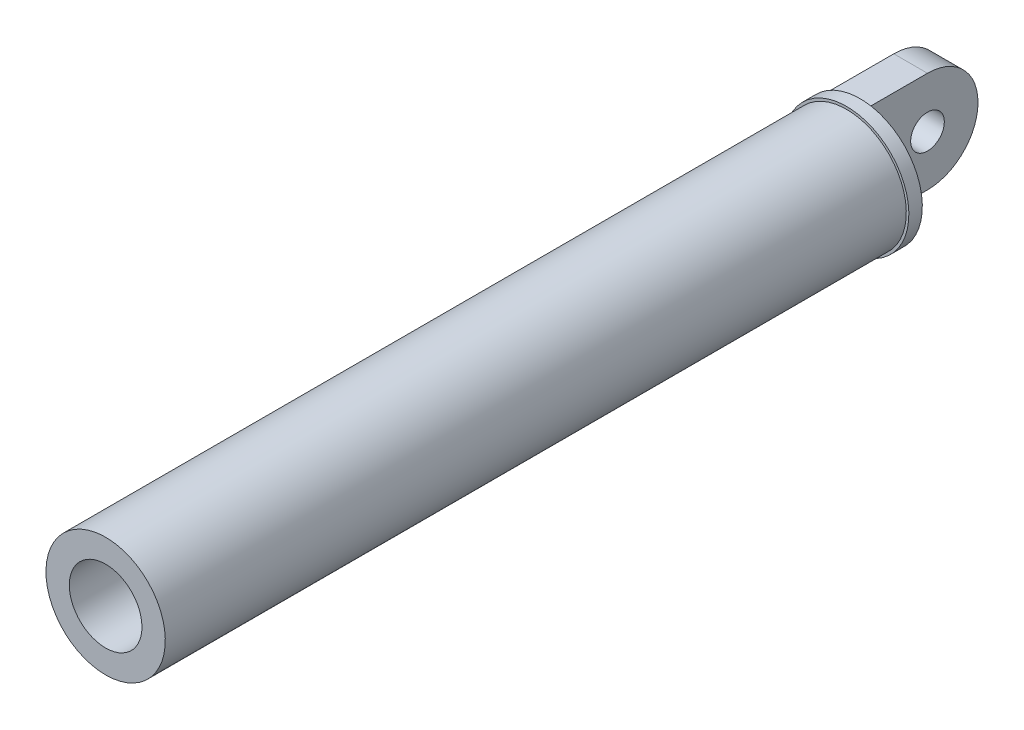
ISO-10303-21;
HEADER;
FILE_DESCRIPTION(('STEP AP214'),'2;1');
FILE_NAME('part.step','',(''),(''),'','','');
FILE_SCHEMA(('AUTOMOTIVE_DESIGN { 1 0 10303 214 1 1 1 1 }'));
ENDSEC;
DATA;
#1=APPLICATION_CONTEXT('core data for automotive mechanical design processes');
#2=APPLICATION_PROTOCOL_DEFINITION('international standard','automotive_design',2000,#1);
#3=PRODUCT_CONTEXT('',#1,'mechanical');
#4=PRODUCT('Part','Part','',(#3));
#5=PRODUCT_RELATED_PRODUCT_CATEGORY('part','',(#4));
#6=PRODUCT_DEFINITION_FORMATION('','',#4);
#7=PRODUCT_DEFINITION_CONTEXT('part definition',#1,'design');
#8=PRODUCT_DEFINITION('design','',#6,#7);
#9=PRODUCT_DEFINITION_SHAPE('','',#8);
#10=(LENGTH_UNIT() NAMED_UNIT(*) SI_UNIT(.MILLI.,.METRE.));
#11=(NAMED_UNIT(*) PLANE_ANGLE_UNIT() SI_UNIT($,.RADIAN.));
#12=(NAMED_UNIT(*) SI_UNIT($,.STERADIAN.) SOLID_ANGLE_UNIT());
#13=UNCERTAINTY_MEASURE_WITH_UNIT(LENGTH_MEASURE(1.E-05),#10,'distance_accuracy_value','');
#14=(GEOMETRIC_REPRESENTATION_CONTEXT(3) GLOBAL_UNCERTAINTY_ASSIGNED_CONTEXT((#13)) GLOBAL_UNIT_ASSIGNED_CONTEXT((#10,
#11,#12)) REPRESENTATION_CONTEXT('',''));
#15=CARTESIAN_POINT('',(0.,0.,0.));
#16=DIRECTION('',(0.,0.,1.));
#17=DIRECTION('',(1.,0.,0.));
#18=AXIS2_PLACEMENT_3D('',#15,#16,#17);
#19=CARTESIAN_POINT('',(5.,0.,0.));
#20=DIRECTION('',(1.,0.,0.));
#21=DIRECTION('',(0.,0.,-1.));
#22=AXIS2_PLACEMENT_3D('',#19,#20,#21);
#23=PLANE('',#22);
#24=CARTESIAN_POINT('',(5.,0.,0.));
#25=DIRECTION('',(1.,0.,0.));
#26=DIRECTION('',(0.,0.,-1.));
#27=AXIS2_PLACEMENT_3D('',#24,#25,#26);
#28=CIRCLE('',#27,15.);
#29=CARTESIAN_POINT('',(5.,-15.,0.));
#30=VERTEX_POINT('',#29);
#31=CARTESIAN_POINT('',(5.,15.,0.));
#32=VERTEX_POINT('',#31);
#33=EDGE_CURVE('E121',#30,#32,#28,.T.);
#34=ORIENTED_EDGE('',*,*,#33,.T.);
#35=DIRECTION('',(0.,0.,1.));
#36=VECTOR('',#35,1.);
#37=CARTESIAN_POINT('',(5.,15.,0.));
#38=LINE('',#37,#36);
#39=CARTESIAN_POINT('',(5.,15.,20.));
#40=VERTEX_POINT('',#39);
#41=EDGE_CURVE('E88',#32,#40,#38,.T.);
#42=ORIENTED_EDGE('',*,*,#41,.T.);
#43=DIRECTION('',(0.,-1.,0.));
#44=VECTOR('',#43,1.);
#45=CARTESIAN_POINT('',(5.,15.,20.));
#46=LINE('',#45,#44);
#47=CARTESIAN_POINT('',(5.,-15.,20.));
#48=VERTEX_POINT('',#47);
#49=EDGE_CURVE('E112',#40,#48,#46,.T.);
#50=ORIENTED_EDGE('',*,*,#49,.T.);
#51=DIRECTION('',(0.,0.,-1.));
#52=VECTOR('',#51,1.);
#53=CARTESIAN_POINT('',(5.,-15.,0.));
#54=LINE('',#53,#52);
#55=EDGE_CURVE('E64',#48,#30,#54,.T.);
#56=ORIENTED_EDGE('',*,*,#55,.T.);
#57=EDGE_LOOP('',(#34,#42,#50,#56));
#58=FACE_BOUND('',#57,.T.);
#59=CARTESIAN_POINT('',(5.,0.,0.));
#60=DIRECTION('',(1.,0.,0.));
#61=DIRECTION('',(0.,0.,-1.));
#62=AXIS2_PLACEMENT_3D('',#59,#60,#61);
#63=CIRCLE('',#62,5.);
#64=CARTESIAN_POINT('',(5.,0.,-5.));
#65=VERTEX_POINT('',#64);
#66=EDGE_CURVE('E125',#65,#65,#63,.T.);
#67=ORIENTED_EDGE('',*,*,#66,.F.);
#68=EDGE_LOOP('',(#67));
#69=FACE_BOUND('',#68,.T.);
#70=ADVANCED_FACE('F46',(#58,#69),#23,.T.);
#71=CARTESIAN_POINT('',(-5.,0.,0.));
#72=DIRECTION('',(1.,0.,0.));
#73=DIRECTION('',(0.,0.,-1.));
#74=AXIS2_PLACEMENT_3D('',#71,#72,#73);
#75=PLANE('',#74);
#76=CARTESIAN_POINT('',(-5.,0.,0.));
#77=DIRECTION('',(1.,0.,0.));
#78=DIRECTION('',(0.,0.,-1.));
#79=AXIS2_PLACEMENT_3D('',#76,#77,#78);
#80=CIRCLE('',#79,15.);
#81=CARTESIAN_POINT('',(-5.,-15.,0.));
#82=VERTEX_POINT('',#81);
#83=CARTESIAN_POINT('',(-5.,15.,0.));
#84=VERTEX_POINT('',#83);
#85=EDGE_CURVE('E108',#82,#84,#80,.T.);
#86=ORIENTED_EDGE('',*,*,#85,.F.);
#87=DIRECTION('',(0.,0.,-1.));
#88=VECTOR('',#87,1.);
#89=CARTESIAN_POINT('',(-5.,-15.,0.));
#90=LINE('',#89,#88);
#91=CARTESIAN_POINT('',(-5.,-15.,20.));
#92=VERTEX_POINT('',#91);
#93=EDGE_CURVE('E81',#92,#82,#90,.T.);
#94=ORIENTED_EDGE('',*,*,#93,.F.);
#95=DIRECTION('',(0.,-1.,0.));
#96=VECTOR('',#95,1.);
#97=CARTESIAN_POINT('',(-5.,15.,20.));
#98=LINE('',#97,#96);
#99=CARTESIAN_POINT('',(-5.,15.,20.));
#100=VERTEX_POINT('',#99);
#101=EDGE_CURVE('E93',#100,#92,#98,.T.);
#102=ORIENTED_EDGE('',*,*,#101,.F.);
#103=DIRECTION('',(0.,0.,1.));
#104=VECTOR('',#103,1.);
#105=CARTESIAN_POINT('',(-5.,15.,0.));
#106=LINE('',#105,#104);
#107=EDGE_CURVE('E98',#84,#100,#106,.T.);
#108=ORIENTED_EDGE('',*,*,#107,.F.);
#109=EDGE_LOOP('',(#86,#94,#102,#108));
#110=FACE_BOUND('',#109,.T.);
#111=CARTESIAN_POINT('',(-5.,0.,0.));
#112=DIRECTION('',(1.,0.,0.));
#113=DIRECTION('',(0.,0.,-1.));
#114=AXIS2_PLACEMENT_3D('',#111,#112,#113);
#115=CIRCLE('',#114,5.);
#116=CARTESIAN_POINT('',(-5.,0.,-5.));
#117=VERTEX_POINT('',#116);
#118=EDGE_CURVE('E134',#117,#117,#115,.T.);
#119=ORIENTED_EDGE('',*,*,#118,.T.);
#120=EDGE_LOOP('',(#119));
#121=FACE_BOUND('',#120,.T.);
#122=ADVANCED_FACE('F96',(#110,#121),#75,.F.);
#123=CARTESIAN_POINT('',(5.,0.,0.));
#124=DIRECTION('',(-1.,0.,0.));
#125=DIRECTION('',(0.,0.,1.));
#126=AXIS2_PLACEMENT_3D('',#123,#124,#125);
#127=CYLINDRICAL_SURFACE('',#126,15.);
#128=ORIENTED_EDGE('',*,*,#85,.T.);
#129=DIRECTION('',(-1.,0.,0.));
#130=VECTOR('',#129,1.);
#131=CARTESIAN_POINT('',(5.,15.,0.));
#132=LINE('',#131,#130);
#133=EDGE_CURVE('E11',#32,#84,#132,.T.);
#134=ORIENTED_EDGE('',*,*,#133,.F.);
#135=ORIENTED_EDGE('',*,*,#33,.F.);
#136=DIRECTION('',(-1.,0.,0.));
#137=VECTOR('',#136,1.);
#138=CARTESIAN_POINT('',(5.,-15.,0.));
#139=LINE('',#138,#137);
#140=EDGE_CURVE('E115',#30,#82,#139,.T.);
#141=ORIENTED_EDGE('',*,*,#140,.T.);
#142=EDGE_LOOP('',(#128,#134,#135,#141));
#143=FACE_BOUND('',#142,.T.);
#144=ADVANCED_FACE('F48',(#143),#127,.T.);
#145=CARTESIAN_POINT('',(5.,15.,0.));
#146=DIRECTION('',(0.,-1.,0.));
#147=DIRECTION('',(0.,0.,-1.));
#148=AXIS2_PLACEMENT_3D('',#145,#146,#147);
#149=PLANE('',#148);
#150=ORIENTED_EDGE('',*,*,#107,.T.);
#151=DIRECTION('',(-1.,0.,0.));
#152=VECTOR('',#151,1.);
#153=CARTESIAN_POINT('',(5.,15.,20.));
#154=LINE('',#153,#152);
#155=EDGE_CURVE('E56',#40,#100,#154,.T.);
#156=ORIENTED_EDGE('',*,*,#155,.F.);
#157=ORIENTED_EDGE('',*,*,#41,.F.);
#158=ORIENTED_EDGE('',*,*,#133,.T.);
#159=EDGE_LOOP('',(#150,#156,#157,#158));
#160=FACE_BOUND('',#159,.T.);
#161=ADVANCED_FACE('F103',(#160),#149,.F.);
#162=CARTESIAN_POINT('',(5.,-15.,0.));
#163=DIRECTION('',(0.,1.,0.));
#164=DIRECTION('',(0.,0.,1.));
#165=AXIS2_PLACEMENT_3D('',#162,#163,#164);
#166=PLANE('',#165);
#167=ORIENTED_EDGE('',*,*,#93,.T.);
#168=ORIENTED_EDGE('',*,*,#140,.F.);
#169=ORIENTED_EDGE('',*,*,#55,.F.);
#170=DIRECTION('',(-1.,0.,0.));
#171=VECTOR('',#170,1.);
#172=CARTESIAN_POINT('',(5.,-15.,20.));
#173=LINE('',#172,#171);
#174=EDGE_CURVE('E78',#48,#92,#173,.T.);
#175=ORIENTED_EDGE('',*,*,#174,.T.);
#176=EDGE_LOOP('',(#167,#168,#169,#175));
#177=FACE_BOUND('',#176,.T.);
#178=ADVANCED_FACE('F213',(#177),#166,.F.);
#179=CARTESIAN_POINT('',(5.,0.,0.));
#180=DIRECTION('',(-1.,0.,0.));
#181=DIRECTION('',(0.,0.,1.));
#182=AXIS2_PLACEMENT_3D('',#179,#180,#181);
#183=CYLINDRICAL_SURFACE('',#182,5.);
#184=ORIENTED_EDGE('',*,*,#66,.T.);
#185=EDGE_LOOP('',(#184));
#186=FACE_BOUND('',#185,.T.);
#187=ORIENTED_EDGE('',*,*,#118,.F.);
#188=EDGE_LOOP('',(#187));
#189=FACE_BOUND('',#188,.T.);
#190=ADVANCED_FACE('F202',(#186,#189),#183,.F.);
#191=CARTESIAN_POINT('',(5.,0.,26.));
#192=DIRECTION('',(0.,0.,-1.));
#193=DIRECTION('',(0.,1.,0.));
#194=AXIS2_PLACEMENT_3D('',#191,#192,#193);
#195=PLANE('',#194);
#196=CARTESIAN_POINT('',(5.,0.,26.));
#197=DIRECTION('',(0.,0.,1.));
#198=DIRECTION('',(0.,-1.,0.));
#199=AXIS2_PLACEMENT_3D('',#196,#197,#198);
#200=CIRCLE('',#199,10.7821929349859);
#201=CARTESIAN_POINT('',(5.,-10.7821929349859,26.));
#202=VERTEX_POINT('',#201);
#203=EDGE_CURVE('E161',#202,#202,#200,.T.);
#204=ORIENTED_EDGE('',*,*,#203,.T.);
#205=EDGE_LOOP('',(#204));
#206=FACE_BOUND('',#205,.T.);
#207=ADVANCED_FACE('F166',(#206),#195,.F.);
#208=CARTESIAN_POINT('',(5.,0.,20.));
#209=DIRECTION('',(0.,0.,-1.));
#210=DIRECTION('',(0.,1.,0.));
#211=AXIS2_PLACEMENT_3D('',#208,#209,#210);
#212=PLANE('',#211);
#213=ORIENTED_EDGE('',*,*,#155,.T.);
#214=ORIENTED_EDGE('',*,*,#101,.T.);
#215=ORIENTED_EDGE('',*,*,#174,.F.);
#216=ORIENTED_EDGE('',*,*,#49,.F.);
#217=EDGE_LOOP('',(#213,#214,#215,#216));
#218=FACE_BOUND('',#217,.T.);
#219=CARTESIAN_POINT('',(5.,0.,20.));
#220=DIRECTION('',(0.,0.,1.));
#221=DIRECTION('',(0.,-1.,0.));
#222=AXIS2_PLACEMENT_3D('',#219,#220,#221);
#223=CIRCLE('',#222,18.4759309205079);
#224=CARTESIAN_POINT('',(5.,-18.4759309205079,20.));
#225=VERTEX_POINT('',#224);
#226=EDGE_CURVE('E138',#225,#225,#223,.T.);
#227=ORIENTED_EDGE('',*,*,#226,.F.);
#228=EDGE_LOOP('',(#227));
#229=FACE_BOUND('',#228,.T.);
#230=ADVANCED_FACE('F110',(#218,#229),#212,.T.);
#231=CARTESIAN_POINT('',(5.,0.,26.));
#232=DIRECTION('',(0.,0.,1.));
#233=DIRECTION('',(0.,-1.,0.));
#234=AXIS2_PLACEMENT_3D('',#231,#232,#233);
#235=CYLINDRICAL_SURFACE('',#234,18.4759309205079);
#236=CARTESIAN_POINT('',(5.,0.,24.));
#237=DIRECTION('',(0.,0.,1.));
#238=DIRECTION('',(0.,-1.,0.));
#239=AXIS2_PLACEMENT_3D('',#236,#237,#238);
#240=CIRCLE('',#239,18.4759309205079);
#241=CARTESIAN_POINT('',(5.,-18.4759309205079,24.));
#242=VERTEX_POINT('',#241);
#243=EDGE_CURVE('E145',#242,#242,#240,.T.);
#244=ORIENTED_EDGE('',*,*,#243,.F.);
#245=EDGE_LOOP('',(#244));
#246=FACE_BOUND('',#245,.T.);
#247=ORIENTED_EDGE('',*,*,#226,.T.);
#248=EDGE_LOOP('',(#247));
#249=FACE_BOUND('',#248,.T.);
#250=ADVANCED_FACE('F189',(#246,#249),#235,.T.);
#251=CARTESIAN_POINT('',(5.,-1.09209887705835E-13,24.));
#252=DIRECTION('',(0.,0.,-1.));
#253=DIRECTION('',(0.,1.,0.));
#254=AXIS2_PLACEMENT_3D('',#251,#252,#253);
#255=PLANE('',#254);
#256=CARTESIAN_POINT('',(5.,0.,24.));
#257=DIRECTION('',(0.,0.,1.));
#258=DIRECTION('',(0.,-1.,0.));
#259=AXIS2_PLACEMENT_3D('',#256,#257,#258);
#260=CIRCLE('',#259,17.7134841439745);
#261=CARTESIAN_POINT('',(5.,-17.7134841439745,24.));
#262=VERTEX_POINT('',#261);
#263=EDGE_CURVE('E149',#262,#262,#260,.T.);
#264=ORIENTED_EDGE('',*,*,#263,.F.);
#265=EDGE_LOOP('',(#264));
#266=FACE_BOUND('',#265,.T.);
#267=ORIENTED_EDGE('',*,*,#243,.T.);
#268=EDGE_LOOP('',(#267));
#269=FACE_BOUND('',#268,.T.);
#270=ADVANCED_FACE('F183',(#266,#269),#255,.F.);
#271=CARTESIAN_POINT('',(5.,0.,26.));
#272=DIRECTION('',(0.,0.,1.));
#273=DIRECTION('',(0.,-1.,0.));
#274=AXIS2_PLACEMENT_3D('',#271,#272,#273);
#275=CYLINDRICAL_SURFACE('',#274,17.7134841439745);
#276=CARTESIAN_POINT('',(5.,1.26056572587648E-13,244.));
#277=DIRECTION('',(0.,0.,1.));
#278=DIRECTION('',(0.,-1.,0.));
#279=AXIS2_PLACEMENT_3D('',#276,#277,#278);
#280=CIRCLE('',#279,17.7134841439744);
#281=CARTESIAN_POINT('',(5.,-17.7134841439743,244.));
#282=VERTEX_POINT('',#281);
#283=EDGE_CURVE('E153',#282,#282,#280,.T.);
#284=ORIENTED_EDGE('',*,*,#283,.F.);
#285=EDGE_LOOP('',(#284));
#286=FACE_BOUND('',#285,.T.);
#287=ORIENTED_EDGE('',*,*,#263,.T.);
#288=EDGE_LOOP('',(#287));
#289=FACE_BOUND('',#288,.T.);
#290=ADVANCED_FACE('F177',(#286,#289),#275,.T.);
#291=CARTESIAN_POINT('',(5.,0.,244.));
#292=DIRECTION('',(0.,0.,-1.));
#293=DIRECTION('',(0.,1.,0.));
#294=AXIS2_PLACEMENT_3D('',#291,#292,#293);
#295=PLANE('',#294);
#296=CARTESIAN_POINT('',(5.,1.26056572587648E-13,244.));
#297=DIRECTION('',(0.,0.,1.));
#298=DIRECTION('',(0.,-1.,0.));
#299=AXIS2_PLACEMENT_3D('',#296,#297,#298);
#300=CIRCLE('',#299,10.7821929349858);
#301=CARTESIAN_POINT('',(5.,-10.7821929349857,244.));
#302=VERTEX_POINT('',#301);
#303=EDGE_CURVE('E157',#302,#302,#300,.T.);
#304=ORIENTED_EDGE('',*,*,#303,.F.);
#305=EDGE_LOOP('',(#304));
#306=FACE_BOUND('',#305,.T.);
#307=ORIENTED_EDGE('',*,*,#283,.T.);
#308=EDGE_LOOP('',(#307));
#309=FACE_BOUND('',#308,.T.);
#310=ADVANCED_FACE('F171',(#306,#309),#295,.F.);
#311=CARTESIAN_POINT('',(5.,0.,26.));
#312=DIRECTION('',(0.,0.,1.));
#313=DIRECTION('',(0.,-1.,0.));
#314=AXIS2_PLACEMENT_3D('',#311,#312,#313);
#315=CYLINDRICAL_SURFACE('',#314,10.7821929349859);
#316=ORIENTED_EDGE('',*,*,#203,.F.);
#317=EDGE_LOOP('',(#316));
#318=FACE_BOUND('',#317,.T.);
#319=ORIENTED_EDGE('',*,*,#303,.T.);
#320=EDGE_LOOP('',(#319));
#321=FACE_BOUND('',#320,.T.);
#322=ADVANCED_FACE('F168',(#318,#321),#315,.F.);
#323=CLOSED_SHELL('',(#70,#122,#144,#161,#178,#190,#207,#230,#250,#270,#290,#310,#322));
#324=MANIFOLD_SOLID_BREP('B2',#323);
#325=ADVANCED_BREP_SHAPE_REPRESENTATION('',(#18,#324),#14);
#326=SHAPE_DEFINITION_REPRESENTATION(#9,#325);
ENDSEC;
END-ISO-10303-21;
